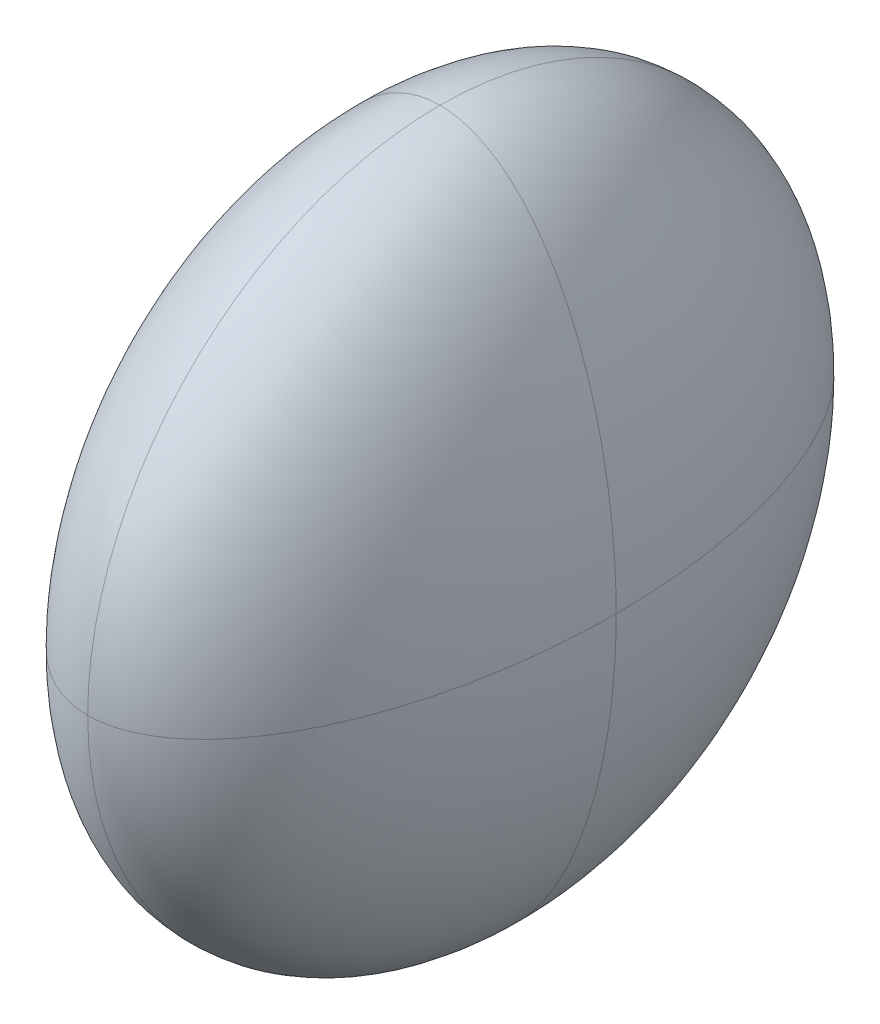
ISO-10303-21;
HEADER;
FILE_DESCRIPTION(('STEP AP214'),'2;1');
FILE_NAME('part.step','',(''),(''),'','','');
FILE_SCHEMA(('AUTOMOTIVE_DESIGN { 1 0 10303 214 1 1 1 1 }'));
ENDSEC;
DATA;
#1=APPLICATION_CONTEXT('core data for automotive mechanical design processes');
#2=APPLICATION_PROTOCOL_DEFINITION('international standard','automotive_design',2000,#1);
#3=PRODUCT_CONTEXT('',#1,'mechanical');
#4=PRODUCT('Part','Part','',(#3));
#5=PRODUCT_RELATED_PRODUCT_CATEGORY('part','',(#4));
#6=PRODUCT_DEFINITION_FORMATION('','',#4);
#7=PRODUCT_DEFINITION_CONTEXT('part definition',#1,'design');
#8=PRODUCT_DEFINITION('design','',#6,#7);
#9=PRODUCT_DEFINITION_SHAPE('','',#8);
#10=(LENGTH_UNIT() NAMED_UNIT(*) SI_UNIT(.MILLI.,.METRE.));
#11=(NAMED_UNIT(*) PLANE_ANGLE_UNIT() SI_UNIT($,.RADIAN.));
#12=(NAMED_UNIT(*) SI_UNIT($,.STERADIAN.) SOLID_ANGLE_UNIT());
#13=UNCERTAINTY_MEASURE_WITH_UNIT(LENGTH_MEASURE(1.E-05),#10,'distance_accuracy_value','');
#14=(GEOMETRIC_REPRESENTATION_CONTEXT(3) GLOBAL_UNCERTAINTY_ASSIGNED_CONTEXT((#13)) GLOBAL_UNIT_ASSIGNED_CONTEXT((#10,
#11,#12)) REPRESENTATION_CONTEXT('',''));
#15=CARTESIAN_POINT('',(0.,0.,0.));
#16=DIRECTION('',(0.,0.,1.));
#17=DIRECTION('',(1.,0.,0.));
#18=AXIS2_PLACEMENT_3D('',#15,#16,#17);
#19=CARTESIAN_POINT('',(1.27,0.,0.5));
#20=CARTESIAN_POINT('',(1.27,2.,0.5));
#21=CARTESIAN_POINT('',(1.27,2.,2.5));
#22=CARTESIAN_POINT('',(0.27,0.,0.5));
#23=CARTESIAN_POINT('',(0.27,2.,0.5));
#24=CARTESIAN_POINT('',(0.27,2.,2.5));
#25=CARTESIAN_POINT('',(0.27,0.,2.5));
#26=CARTESIAN_POINT('',(0.27,0.,2.5));
#27=CARTESIAN_POINT('',(0.27,0.,2.5));
#28=(BOUNDED_SURFACE() B_SPLINE_SURFACE(2,2,((#19,#20,#21),(#22,#23,#24),(#25,#26,#27)),
.UNSPECIFIED.,.F.,.F.,.F.) B_SPLINE_SURFACE_WITH_KNOTS((3,3),(3,3),(4.712388980385,
6.28318530718),(4.712388980385,6.28318530718),
.UNSPECIFIED.) GEOMETRIC_REPRESENTATION_ITEM() RATIONAL_B_SPLINE_SURFACE(((1.,0.707106781187,
1.),(0.707106781187,0.5,0.707106781187),(1.,0.707106781187,1.))) REPRESENTATION_ITEM('') SURFACE());
#29=CARTESIAN_POINT('',(1.27,0.,0.5));
#30=CARTESIAN_POINT('',(0.27,0.,0.5));
#31=CARTESIAN_POINT('',(0.27,0.,2.5));
#32=(BOUNDED_CURVE() B_SPLINE_CURVE(2,(#29,#30,#31),.UNSPECIFIED.,.F.,
.F.) B_SPLINE_CURVE_WITH_KNOTS((3,3),(4.712388980385,6.28318530718),
.UNSPECIFIED.) CURVE() GEOMETRIC_REPRESENTATION_ITEM() RATIONAL_B_SPLINE_CURVE((1.,
0.707106781187,1.)) REPRESENTATION_ITEM(''));
#33=CARTESIAN_POINT('',(1.27,0.,0.499999999999927));
#34=VERTEX_POINT('',#33);
#35=CARTESIAN_POINT('',(0.27,0.,2.5));
#36=VERTEX_POINT('',#35);
#37=EDGE_CURVE('E66',#34,#36,#32,.T.);
#38=CARTESIAN_POINT('',(1.27,2.,2.5));
#39=CARTESIAN_POINT('',(0.27,2.,2.5));
#40=CARTESIAN_POINT('',(0.27,0.,2.5));
#41=(BOUNDED_CURVE() B_SPLINE_CURVE(2,(#38,#39,#40),.UNSPECIFIED.,.F.,
.F.) B_SPLINE_CURVE_WITH_KNOTS((3,3),(4.712388980385,6.28318530718),
.UNSPECIFIED.) CURVE() GEOMETRIC_REPRESENTATION_ITEM() RATIONAL_B_SPLINE_CURVE((1.,
0.707106781187,1.)) REPRESENTATION_ITEM(''));
#42=CARTESIAN_POINT('',(1.27,2.00000000000007,2.5));
#43=VERTEX_POINT('',#42);
#44=EDGE_CURVE('E22',#36,#43,#41,.F.);
#45=CARTESIAN_POINT('',(1.27,0.,2.5));
#46=DIRECTION('',(-1.,0.,0.));
#47=DIRECTION('',(0.,0.,1.));
#48=AXIS2_PLACEMENT_3D('',#45,#46,#47);
#49=CIRCLE('',#48,2.00000000000007);
#50=EDGE_CURVE('E52',#43,#34,#49,.T.);
#51=ORIENTED_EDGE('',*,*,#37,.T.);
#52=ORIENTED_EDGE('',*,*,#44,.T.);
#53=ORIENTED_EDGE('',*,*,#50,.T.);
#54=EDGE_LOOP('',(#51,#52,#53));
#55=FACE_BOUND('',#54,.T.);
#56=ADVANCED_FACE('F17',(#55),#28,.T.);
#57=CARTESIAN_POINT('',(1.27,0.,4.5));
#58=CARTESIAN_POINT('',(1.27,2.,4.5));
#59=CARTESIAN_POINT('',(1.27,2.,2.5));
#60=CARTESIAN_POINT('',(0.27,0.,4.5));
#61=CARTESIAN_POINT('',(0.27,2.,4.5));
#62=CARTESIAN_POINT('',(0.27,2.,2.5));
#63=CARTESIAN_POINT('',(0.27,0.,2.5));
#64=CARTESIAN_POINT('',(0.27,0.,2.5));
#65=CARTESIAN_POINT('',(0.27,0.,2.5));
#66=(BOUNDED_SURFACE() B_SPLINE_SURFACE(2,2,((#57,#58,#59),(#60,#61,#62),(#63,#64,#65)),
.UNSPECIFIED.,.F.,.F.,.F.) B_SPLINE_SURFACE_WITH_KNOTS((3,3),(3,3),(4.712388980385,
6.28318530718),(4.712388980385,6.28318530718),
.UNSPECIFIED.) GEOMETRIC_REPRESENTATION_ITEM() RATIONAL_B_SPLINE_SURFACE(((1.,0.707106781187,
1.),(0.707106781187,0.5,0.707106781187),(1.,0.707106781187,1.))) REPRESENTATION_ITEM('') SURFACE());
#67=CARTESIAN_POINT('',(1.27,0.,4.5));
#68=CARTESIAN_POINT('',(0.27,0.,4.5));
#69=CARTESIAN_POINT('',(0.27,0.,2.5));
#70=(BOUNDED_CURVE() B_SPLINE_CURVE(2,(#67,#68,#69),.UNSPECIFIED.,.F.,
.F.) B_SPLINE_CURVE_WITH_KNOTS((3,3),(4.712388980385,6.28318530718),
.UNSPECIFIED.) CURVE() GEOMETRIC_REPRESENTATION_ITEM() RATIONAL_B_SPLINE_CURVE((1.,
0.707106781187,1.)) REPRESENTATION_ITEM(''));
#71=CARTESIAN_POINT('',(1.27,0.,4.50000000000007));
#72=VERTEX_POINT('',#71);
#73=EDGE_CURVE('E60',#72,#36,#70,.T.);
#74=CARTESIAN_POINT('',(1.27,0.,2.5));
#75=DIRECTION('',(1.,0.,0.));
#76=DIRECTION('',(0.,0.,-1.));
#77=AXIS2_PLACEMENT_3D('',#74,#75,#76);
#78=CIRCLE('',#77,2.00000000000007);
#79=EDGE_CURVE('E62',#43,#72,#78,.T.);
#80=ORIENTED_EDGE('',*,*,#73,.F.);
#81=ORIENTED_EDGE('',*,*,#79,.F.);
#82=ORIENTED_EDGE('',*,*,#44,.F.);
#83=EDGE_LOOP('',(#80,#81,#82));
#84=FACE_BOUND('',#83,.T.);
#85=ADVANCED_FACE('F59',(#84),#66,.F.);
#86=CARTESIAN_POINT('',(1.27,0.,0.5));
#87=CARTESIAN_POINT('',(1.27,-2.,0.5));
#88=CARTESIAN_POINT('',(1.27,-2.,2.5));
#89=CARTESIAN_POINT('',(0.27,0.,0.5));
#90=CARTESIAN_POINT('',(0.27,-2.,0.5));
#91=CARTESIAN_POINT('',(0.27,-2.,2.5));
#92=CARTESIAN_POINT('',(0.27,0.,2.5));
#93=CARTESIAN_POINT('',(0.27,0.,2.5));
#94=CARTESIAN_POINT('',(0.27,0.,2.5));
#95=(BOUNDED_SURFACE() B_SPLINE_SURFACE(2,2,((#86,#87,#88),(#89,#90,#91),(#92,#93,#94)),
.UNSPECIFIED.,.F.,.F.,.F.) B_SPLINE_SURFACE_WITH_KNOTS((3,3),(3,3),(4.712388980385,
6.28318530718),(4.712388980385,6.28318530718),
.UNSPECIFIED.) GEOMETRIC_REPRESENTATION_ITEM() RATIONAL_B_SPLINE_SURFACE(((1.,0.707106781187,
1.),(0.707106781187,0.5,0.707106781187),(1.,0.707106781187,1.))) REPRESENTATION_ITEM('') SURFACE());
#96=CARTESIAN_POINT('',(1.27,0.,2.5));
#97=DIRECTION('',(1.,0.,0.));
#98=DIRECTION('',(0.,0.,-1.));
#99=AXIS2_PLACEMENT_3D('',#96,#97,#98);
#100=CIRCLE('',#99,2.00000000000007);
#101=CARTESIAN_POINT('',(1.27,-2.00000000000007,2.5));
#102=VERTEX_POINT('',#101);
#103=EDGE_CURVE('E78',#102,#34,#100,.T.);
#104=CARTESIAN_POINT('',(1.27,-2.,2.5));
#105=CARTESIAN_POINT('',(0.27,-2.,2.5));
#106=CARTESIAN_POINT('',(0.27,0.,2.5));
#107=(BOUNDED_CURVE() B_SPLINE_CURVE(2,(#104,#105,#106),.UNSPECIFIED.,.F.,
.F.) B_SPLINE_CURVE_WITH_KNOTS((3,3),(4.712388980385,6.28318530718),
.UNSPECIFIED.) CURVE() GEOMETRIC_REPRESENTATION_ITEM() RATIONAL_B_SPLINE_CURVE((1.,
0.707106781187,1.)) REPRESENTATION_ITEM(''));
#108=EDGE_CURVE('E71',#36,#102,#107,.F.);
#109=ORIENTED_EDGE('',*,*,#37,.F.);
#110=ORIENTED_EDGE('',*,*,#103,.F.);
#111=ORIENTED_EDGE('',*,*,#108,.F.);
#112=EDGE_LOOP('',(#109,#110,#111));
#113=FACE_BOUND('',#112,.T.);
#114=ADVANCED_FACE('F77',(#113),#95,.F.);
#115=CARTESIAN_POINT('',(1.27,0.,0.5));
#116=CARTESIAN_POINT('',(1.27,2.,0.5));
#117=CARTESIAN_POINT('',(1.27,2.,2.5));
#118=CARTESIAN_POINT('',(2.27,0.,0.5));
#119=CARTESIAN_POINT('',(2.27,2.,0.5));
#120=CARTESIAN_POINT('',(2.27,2.,2.5));
#121=CARTESIAN_POINT('',(2.27,0.,2.5));
#122=CARTESIAN_POINT('',(2.27,0.,2.5));
#123=CARTESIAN_POINT('',(2.27,0.,2.5));
#124=(BOUNDED_SURFACE() B_SPLINE_SURFACE(2,2,((#115,#116,#117),(#118,#119,#120),(#121,#122,
#123)),.UNSPECIFIED.,.F.,.F.,.F.) B_SPLINE_SURFACE_WITH_KNOTS((3,3),(3,3),(4.712388980385,
6.28318530718),(4.712388980385,6.28318530718),
.UNSPECIFIED.) GEOMETRIC_REPRESENTATION_ITEM() RATIONAL_B_SPLINE_SURFACE(((1.,0.707106781187,
1.),(0.707106781187,0.5,0.707106781187),(1.,0.707106781187,1.))) REPRESENTATION_ITEM('') SURFACE());
#125=CARTESIAN_POINT('',(1.27,0.,0.5));
#126=CARTESIAN_POINT('',(2.27,0.,0.5));
#127=CARTESIAN_POINT('',(2.27,0.,2.5));
#128=(BOUNDED_CURVE() B_SPLINE_CURVE(2,(#125,#126,#127),.UNSPECIFIED.,.F.,
.F.) B_SPLINE_CURVE_WITH_KNOTS((3,3),(4.712388980385,6.28318530718),
.UNSPECIFIED.) CURVE() GEOMETRIC_REPRESENTATION_ITEM() RATIONAL_B_SPLINE_CURVE((1.,
0.707106781187,1.)) REPRESENTATION_ITEM(''));
#129=CARTESIAN_POINT('',(2.27,0.,2.5));
#130=VERTEX_POINT('',#129);
#131=EDGE_CURVE('E38',#34,#130,#128,.T.);
#132=CARTESIAN_POINT('',(1.27,2.,2.5));
#133=CARTESIAN_POINT('',(2.27,2.,2.5));
#134=CARTESIAN_POINT('',(2.27,0.,2.5));
#135=(BOUNDED_CURVE() B_SPLINE_CURVE(2,(#132,#133,#134),.UNSPECIFIED.,.F.,
.F.) B_SPLINE_CURVE_WITH_KNOTS((3,3),(4.712388980385,6.28318530718),
.UNSPECIFIED.) CURVE() GEOMETRIC_REPRESENTATION_ITEM() RATIONAL_B_SPLINE_CURVE((1.,
0.707106781187,1.)) REPRESENTATION_ITEM(''));
#136=EDGE_CURVE('E80',#130,#43,#135,.F.);
#137=ORIENTED_EDGE('',*,*,#131,.F.);
#138=ORIENTED_EDGE('',*,*,#50,.F.);
#139=ORIENTED_EDGE('',*,*,#136,.F.);
#140=EDGE_LOOP('',(#137,#138,#139));
#141=FACE_BOUND('',#140,.T.);
#142=ADVANCED_FACE('F160',(#141),#124,.F.);
#143=CARTESIAN_POINT('',(1.27,0.,4.5));
#144=CARTESIAN_POINT('',(1.27,-2.,4.5));
#145=CARTESIAN_POINT('',(1.27,-2.,2.5));
#146=CARTESIAN_POINT('',(0.27,0.,4.5));
#147=CARTESIAN_POINT('',(0.27,-2.,4.5));
#148=CARTESIAN_POINT('',(0.27,-2.,2.5));
#149=CARTESIAN_POINT('',(0.27,0.,2.5));
#150=CARTESIAN_POINT('',(0.27,0.,2.5));
#151=CARTESIAN_POINT('',(0.27,0.,2.5));
#152=(BOUNDED_SURFACE() B_SPLINE_SURFACE(2,2,((#143,#144,#145),(#146,#147,#148),(#149,#150,
#151)),.UNSPECIFIED.,.F.,.F.,.F.) B_SPLINE_SURFACE_WITH_KNOTS((3,3),(3,3),(4.712388980385,
6.28318530718),(4.712388980385,6.28318530718),
.UNSPECIFIED.) GEOMETRIC_REPRESENTATION_ITEM() RATIONAL_B_SPLINE_SURFACE(((1.,0.707106781187,
1.),(0.707106781187,0.5,0.707106781187),(1.,0.707106781187,1.))) REPRESENTATION_ITEM('') SURFACE());
#153=CARTESIAN_POINT('',(1.27,0.,2.5));
#154=DIRECTION('',(-1.,0.,0.));
#155=DIRECTION('',(0.,0.,1.));
#156=AXIS2_PLACEMENT_3D('',#153,#154,#155);
#157=CIRCLE('',#156,2.00000000000007);
#158=EDGE_CURVE('E73',#102,#72,#157,.T.);
#159=ORIENTED_EDGE('',*,*,#73,.T.);
#160=ORIENTED_EDGE('',*,*,#108,.T.);
#161=ORIENTED_EDGE('',*,*,#158,.T.);
#162=EDGE_LOOP('',(#159,#160,#161));
#163=FACE_BOUND('',#162,.T.);
#164=ADVANCED_FACE('F69',(#163),#152,.T.);
#165=CARTESIAN_POINT('',(1.27,0.,4.5));
#166=CARTESIAN_POINT('',(1.27,2.,4.5));
#167=CARTESIAN_POINT('',(1.27,2.,2.5));
#168=CARTESIAN_POINT('',(2.27,0.,4.5));
#169=CARTESIAN_POINT('',(2.27,2.,4.5));
#170=CARTESIAN_POINT('',(2.27,2.,2.5));
#171=CARTESIAN_POINT('',(2.27,0.,2.5));
#172=CARTESIAN_POINT('',(2.27,0.,2.5));
#173=CARTESIAN_POINT('',(2.27,0.,2.5));
#174=(BOUNDED_SURFACE() B_SPLINE_SURFACE(2,2,((#165,#166,#167),(#168,#169,#170),(#171,#172,
#173)),.UNSPECIFIED.,.F.,.F.,.F.) B_SPLINE_SURFACE_WITH_KNOTS((3,3),(3,3),(4.712388980385,
6.28318530718),(4.712388980385,6.28318530718),
.UNSPECIFIED.) GEOMETRIC_REPRESENTATION_ITEM() RATIONAL_B_SPLINE_SURFACE(((1.,0.707106781187,
1.),(0.707106781187,0.5,0.707106781187),(1.,0.707106781187,1.))) REPRESENTATION_ITEM('') SURFACE());
#175=CARTESIAN_POINT('',(1.27,0.,4.5));
#176=CARTESIAN_POINT('',(2.27,0.,4.5));
#177=CARTESIAN_POINT('',(2.27,0.,2.5));
#178=(BOUNDED_CURVE() B_SPLINE_CURVE(2,(#175,#176,#177),.UNSPECIFIED.,.F.,
.F.) B_SPLINE_CURVE_WITH_KNOTS((3,3),(4.712388980385,6.28318530718),
.UNSPECIFIED.) CURVE() GEOMETRIC_REPRESENTATION_ITEM() RATIONAL_B_SPLINE_CURVE((1.,
0.707106781187,1.)) REPRESENTATION_ITEM(''));
#179=EDGE_CURVE('E30',#72,#130,#178,.T.);
#180=ORIENTED_EDGE('',*,*,#179,.T.);
#181=ORIENTED_EDGE('',*,*,#136,.T.);
#182=ORIENTED_EDGE('',*,*,#79,.T.);
#183=EDGE_LOOP('',(#180,#181,#182));
#184=FACE_BOUND('',#183,.T.);
#185=ADVANCED_FACE('F125',(#184),#174,.T.);
#186=CARTESIAN_POINT('',(1.27,0.,0.5));
#187=CARTESIAN_POINT('',(1.27,-2.,0.5));
#188=CARTESIAN_POINT('',(1.27,-2.,2.5));
#189=CARTESIAN_POINT('',(2.27,0.,0.5));
#190=CARTESIAN_POINT('',(2.27,-2.,0.5));
#191=CARTESIAN_POINT('',(2.27,-2.,2.5));
#192=CARTESIAN_POINT('',(2.27,0.,2.5));
#193=CARTESIAN_POINT('',(2.27,0.,2.5));
#194=CARTESIAN_POINT('',(2.27,0.,2.5));
#195=(BOUNDED_SURFACE() B_SPLINE_SURFACE(2,2,((#186,#187,#188),(#189,#190,#191),(#192,#193,
#194)),.UNSPECIFIED.,.F.,.F.,.F.) B_SPLINE_SURFACE_WITH_KNOTS((3,3),(3,3),(4.712388980385,
6.28318530718),(4.712388980385,6.28318530718),
.UNSPECIFIED.) GEOMETRIC_REPRESENTATION_ITEM() RATIONAL_B_SPLINE_SURFACE(((1.,0.707106781187,
1.),(0.707106781187,0.5,0.707106781187),(1.,0.707106781187,1.))) REPRESENTATION_ITEM('') SURFACE());
#196=CARTESIAN_POINT('',(1.27,-2.,2.5));
#197=CARTESIAN_POINT('',(2.27,-2.,2.5));
#198=CARTESIAN_POINT('',(2.27,0.,2.5));
#199=(BOUNDED_CURVE() B_SPLINE_CURVE(2,(#196,#197,#198),.UNSPECIFIED.,.F.,
.F.) B_SPLINE_CURVE_WITH_KNOTS((3,3),(4.712388980385,6.28318530718),
.UNSPECIFIED.) CURVE() GEOMETRIC_REPRESENTATION_ITEM() RATIONAL_B_SPLINE_CURVE((1.,
0.707106781187,1.)) REPRESENTATION_ITEM(''));
#200=EDGE_CURVE('E11',#130,#102,#199,.F.);
#201=ORIENTED_EDGE('',*,*,#131,.T.);
#202=ORIENTED_EDGE('',*,*,#200,.T.);
#203=ORIENTED_EDGE('',*,*,#103,.T.);
#204=EDGE_LOOP('',(#201,#202,#203));
#205=FACE_BOUND('',#204,.T.);
#206=ADVANCED_FACE('F129',(#205),#195,.T.);
#207=CARTESIAN_POINT('',(1.27,0.,4.5));
#208=CARTESIAN_POINT('',(1.27,-2.,4.5));
#209=CARTESIAN_POINT('',(1.27,-2.,2.5));
#210=CARTESIAN_POINT('',(2.27,0.,4.5));
#211=CARTESIAN_POINT('',(2.27,-2.,4.5));
#212=CARTESIAN_POINT('',(2.27,-2.,2.5));
#213=CARTESIAN_POINT('',(2.27,0.,2.5));
#214=CARTESIAN_POINT('',(2.27,0.,2.5));
#215=CARTESIAN_POINT('',(2.27,0.,2.5));
#216=(BOUNDED_SURFACE() B_SPLINE_SURFACE(2,2,((#207,#208,#209),(#210,#211,#212),(#213,#214,
#215)),.UNSPECIFIED.,.F.,.F.,.F.) B_SPLINE_SURFACE_WITH_KNOTS((3,3),(3,3),(4.712388980385,
6.28318530718),(4.712388980385,6.28318530718),
.UNSPECIFIED.) GEOMETRIC_REPRESENTATION_ITEM() RATIONAL_B_SPLINE_SURFACE(((1.,0.707106781187,
1.),(0.707106781187,0.5,0.707106781187),(1.,0.707106781187,1.))) REPRESENTATION_ITEM('') SURFACE());
#217=ORIENTED_EDGE('',*,*,#179,.F.);
#218=ORIENTED_EDGE('',*,*,#158,.F.);
#219=ORIENTED_EDGE('',*,*,#200,.F.);
#220=EDGE_LOOP('',(#217,#218,#219));
#221=FACE_BOUND('',#220,.T.);
#222=ADVANCED_FACE('F128',(#221),#216,.F.);
#223=CLOSED_SHELL('',(#56,#85,#114,#142,#164,#185,#206,#222));
#224=MANIFOLD_SOLID_BREP('B1',#223);
#225=ADVANCED_BREP_SHAPE_REPRESENTATION('',(#18,#224),#14);
#226=SHAPE_DEFINITION_REPRESENTATION(#9,#225);
ENDSEC;
END-ISO-10303-21;
